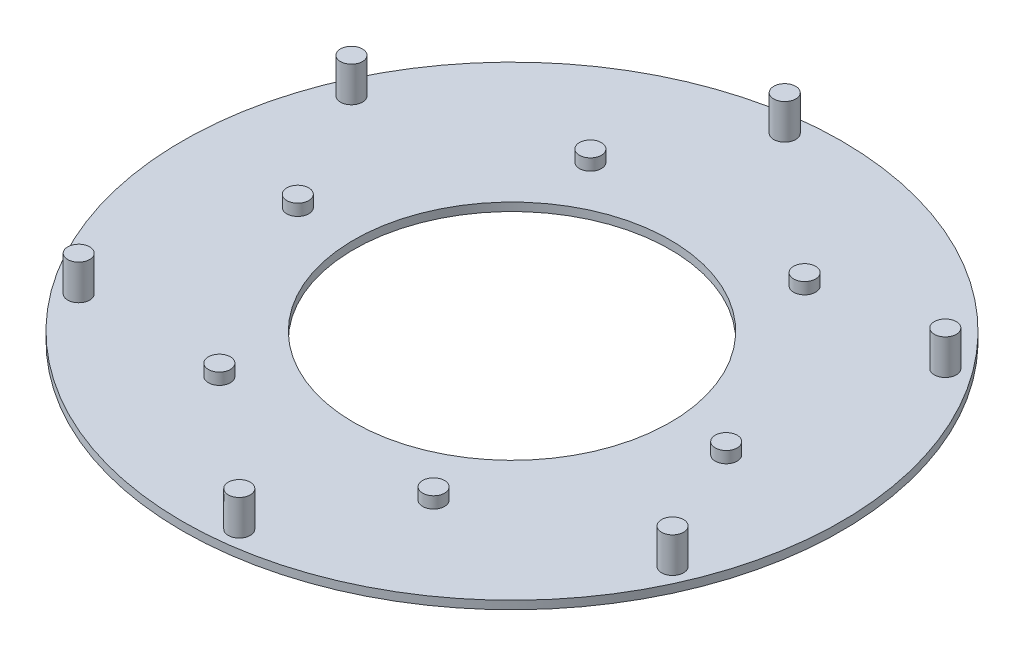
ISO-10303-21;
HEADER;
FILE_DESCRIPTION(('STEP AP214'),'2;1');
FILE_NAME('part.step','',(''),(''),'','','');
FILE_SCHEMA(('AUTOMOTIVE_DESIGN { 1 0 10303 214 1 1 1 1 }'));
ENDSEC;
DATA;
#1=APPLICATION_CONTEXT('core data for automotive mechanical design processes');
#2=APPLICATION_PROTOCOL_DEFINITION('international standard','automotive_design',2000,#1);
#3=PRODUCT_CONTEXT('',#1,'mechanical');
#4=PRODUCT('Part','Part','',(#3));
#5=PRODUCT_RELATED_PRODUCT_CATEGORY('part','',(#4));
#6=PRODUCT_DEFINITION_FORMATION('','',#4);
#7=PRODUCT_DEFINITION_CONTEXT('part definition',#1,'design');
#8=PRODUCT_DEFINITION('design','',#6,#7);
#9=PRODUCT_DEFINITION_SHAPE('','',#8);
#10=(LENGTH_UNIT() NAMED_UNIT(*) SI_UNIT(.MILLI.,.METRE.));
#11=(NAMED_UNIT(*) PLANE_ANGLE_UNIT() SI_UNIT($,.RADIAN.));
#12=(NAMED_UNIT(*) SI_UNIT($,.STERADIAN.) SOLID_ANGLE_UNIT());
#13=UNCERTAINTY_MEASURE_WITH_UNIT(LENGTH_MEASURE(1.E-05),#10,'distance_accuracy_value','');
#14=(GEOMETRIC_REPRESENTATION_CONTEXT(3) GLOBAL_UNCERTAINTY_ASSIGNED_CONTEXT((#13)) GLOBAL_UNIT_ASSIGNED_CONTEXT((#10,
#11,#12)) REPRESENTATION_CONTEXT('',''));
#15=CARTESIAN_POINT('',(0.,0.,0.));
#16=DIRECTION('',(0.,0.,1.));
#17=DIRECTION('',(1.,0.,0.));
#18=AXIS2_PLACEMENT_3D('',#15,#16,#17);
#19=CARTESIAN_POINT('',(0.,3.0625,0.));
#20=DIRECTION('',(0.,1.,0.));
#21=DIRECTION('',(0.,0.,1.));
#22=AXIS2_PLACEMENT_3D('',#19,#20,#21);
#23=PLANE('',#22);
#24=CARTESIAN_POINT('',(-4.7884959423829,3.0625,-42.0280894951196));
#25=DIRECTION('',(0.,1.,0.));
#26=DIRECTION('',(0.,0.,1.));
#27=AXIS2_PLACEMENT_3D('',#24,#25,#26);
#28=CIRCLE('',#27,1.5);
#29=CARTESIAN_POINT('',(-4.7884959423829,3.0625,-40.5280894951196));
#30=VERTEX_POINT('',#29);
#31=EDGE_CURVE('E10',#30,#30,#28,.T.);
#32=ORIENTED_EDGE('',*,*,#31,.F.);
#33=EDGE_LOOP('',(#32));
#34=FACE_BOUND('',#33,.T.);
#35=CARTESIAN_POINT('',(34.0031452041081,3.0625,-25.161003879582));
#36=DIRECTION('',(0.,1.,0.));
#37=DIRECTION('',(0.,0.,1.));
#38=AXIS2_PLACEMENT_3D('',#35,#36,#37);
#39=CIRCLE('',#38,1.5);
#40=CARTESIAN_POINT('',(34.0031452041081,3.0625,-23.661003879582));
#41=VERTEX_POINT('',#40);
#42=EDGE_CURVE('E49',#41,#41,#39,.T.);
#43=ORIENTED_EDGE('',*,*,#42,.F.);
#44=EDGE_LOOP('',(#43));
#45=FACE_BOUND('',#44,.T.);
#46=CARTESIAN_POINT('',(38.7916411464907,3.0625,16.867085615538));
#47=DIRECTION('',(0.,1.,0.));
#48=DIRECTION('',(0.,0.,1.));
#49=AXIS2_PLACEMENT_3D('',#46,#47,#48);
#50=CIRCLE('',#49,1.5);
#51=CARTESIAN_POINT('',(38.7916411464907,3.0625,18.367085615538));
#52=VERTEX_POINT('',#51);
#53=EDGE_CURVE('E54',#52,#52,#50,.T.);
#54=ORIENTED_EDGE('',*,*,#53,.F.);
#55=EDGE_LOOP('',(#54));
#56=FACE_BOUND('',#55,.T.);
#57=CARTESIAN_POINT('',(4.7884959423826,3.0625,42.0280894951197));
#58=DIRECTION('',(0.,1.,0.));
#59=DIRECTION('',(0.,0.,1.));
#60=AXIS2_PLACEMENT_3D('',#57,#58,#59);
#61=CIRCLE('',#60,1.5);
#62=CARTESIAN_POINT('',(4.7884959423826,3.0625,43.5280894951197));
#63=VERTEX_POINT('',#62);
#64=EDGE_CURVE('E68',#63,#63,#61,.T.);
#65=ORIENTED_EDGE('',*,*,#64,.F.);
#66=EDGE_LOOP('',(#65));
#67=FACE_BOUND('',#66,.T.);
#68=CARTESIAN_POINT('',(-34.0031452041083,3.0625,25.1610038795818));
#69=DIRECTION('',(0.,1.,0.));
#70=DIRECTION('',(0.,0.,1.));
#71=AXIS2_PLACEMENT_3D('',#68,#69,#70);
#72=CIRCLE('',#71,1.5);
#73=CARTESIAN_POINT('',(-34.0031452041083,3.0625,26.6610038795818));
#74=VERTEX_POINT('',#73);
#75=EDGE_CURVE('E74',#74,#74,#72,.T.);
#76=ORIENTED_EDGE('',*,*,#75,.F.);
#77=EDGE_LOOP('',(#76));
#78=FACE_BOUND('',#77,.T.);
#79=CARTESIAN_POINT('',(-29.2499999999986,3.0625,-5.78712308488233E-13));
#80=DIRECTION('',(0.,1.,0.));
#81=DIRECTION('',(0.,0.,1.));
#82=AXIS2_PLACEMENT_3D('',#79,#80,#81);
#83=CIRCLE('',#82,1.50000000000084);
#84=CARTESIAN_POINT('',(-29.2499999999986,3.0625,1.50000000000026));
#85=VERTEX_POINT('',#84);
#86=EDGE_CURVE('E80',#85,#85,#83,.T.);
#87=ORIENTED_EDGE('',*,*,#86,.F.);
#88=EDGE_LOOP('',(#87));
#89=FACE_BOUND('',#88,.T.);
#90=CARTESIAN_POINT('',(-14.6249999999974,3.0625,-25.3312430606947));
#91=DIRECTION('',(0.,1.,0.));
#92=DIRECTION('',(0.,0.,1.));
#93=AXIS2_PLACEMENT_3D('',#90,#91,#92);
#94=CIRCLE('',#93,1.50000000000237);
#95=CARTESIAN_POINT('',(-14.6249999999974,3.0625,-23.8312430606923));
#96=VERTEX_POINT('',#95);
#97=EDGE_CURVE('E86',#96,#96,#94,.T.);
#98=ORIENTED_EDGE('',*,*,#97,.F.);
#99=EDGE_LOOP('',(#98));
#100=FACE_BOUND('',#99,.T.);
#101=CARTESIAN_POINT('',(14.6250000000026,3.0625,-25.3312430606933));
#102=DIRECTION('',(0.,1.,0.));
#103=DIRECTION('',(0.,0.,1.));
#104=AXIS2_PLACEMENT_3D('',#101,#102,#103);
#105=CIRCLE('',#104,1.50000000000342);
#106=CARTESIAN_POINT('',(14.6250000000026,3.0625,-23.8312430606899));
#107=VERTEX_POINT('',#106);
#108=EDGE_CURVE('E92',#107,#107,#105,.T.);
#109=ORIENTED_EDGE('',*,*,#108,.F.);
#110=EDGE_LOOP('',(#109));
#111=FACE_BOUND('',#110,.T.);
#112=CARTESIAN_POINT('',(29.2500000000014,3.0625,2.21282182285838E-12));
#113=DIRECTION('',(0.,1.,0.));
#114=DIRECTION('',(0.,0.,1.));
#115=AXIS2_PLACEMENT_3D('',#112,#113,#114);
#116=CIRCLE('',#115,1.50000000000287);
#117=CARTESIAN_POINT('',(29.2500000000014,3.0625,1.50000000000508));
#118=VERTEX_POINT('',#117);
#119=EDGE_CURVE('E98',#118,#118,#116,.T.);
#120=ORIENTED_EDGE('',*,*,#119,.F.);
#121=EDGE_LOOP('',(#120));
#122=FACE_BOUND('',#121,.T.);
#123=CARTESIAN_POINT('',(14.6250000000002,3.0625,25.3312430606964));
#124=DIRECTION('',(0.,1.,0.));
#125=DIRECTION('',(0.,0.,1.));
#126=AXIS2_PLACEMENT_3D('',#123,#124,#125);
#127=CIRCLE('',#126,1.5000000000012);
#128=CARTESIAN_POINT('',(14.6250000000002,3.0625,26.8312430606976));
#129=VERTEX_POINT('',#128);
#130=EDGE_CURVE('E104',#129,#129,#127,.T.);
#131=ORIENTED_EDGE('',*,*,#130,.F.);
#132=EDGE_LOOP('',(#131));
#133=FACE_BOUND('',#132,.T.);
#134=CARTESIAN_POINT('',(-14.6249999999998,3.0625,25.331243060695));
#135=DIRECTION('',(0.,1.,0.));
#136=DIRECTION('',(0.,0.,1.));
#137=AXIS2_PLACEMENT_3D('',#134,#135,#136);
#138=CIRCLE('',#137,1.5);
#139=CARTESIAN_POINT('',(-14.6249999999998,3.0625,26.831243060695));
#140=VERTEX_POINT('',#139);
#141=EDGE_CURVE('E110',#140,#140,#138,.T.);
#142=ORIENTED_EDGE('',*,*,#141,.F.);
#143=EDGE_LOOP('',(#142));
#144=FACE_BOUND('',#143,.T.);
#145=CARTESIAN_POINT('',(-38.7916411464907,3.0625,-16.867085615538));
#146=DIRECTION('',(0.,1.,0.));
#147=DIRECTION('',(0.,0.,1.));
#148=AXIS2_PLACEMENT_3D('',#145,#146,#147);
#149=CIRCLE('',#148,1.5);
#150=CARTESIAN_POINT('',(-38.7916411464907,3.0625,-15.367085615538));
#151=VERTEX_POINT('',#150);
#152=EDGE_CURVE('E116',#151,#151,#149,.T.);
#153=ORIENTED_EDGE('',*,*,#152,.F.);
#154=EDGE_LOOP('',(#153));
#155=FACE_BOUND('',#154,.T.);
#156=CARTESIAN_POINT('',(0.,3.0625,0.));
#157=DIRECTION('',(0.,1.,0.));
#158=DIRECTION('',(0.,0.,1.));
#159=AXIS2_PLACEMENT_3D('',#156,#157,#158);
#160=CIRCLE('',#159,45.);
#161=CARTESIAN_POINT('',(0.,3.0625,45.));
#162=VERTEX_POINT('',#161);
#163=EDGE_CURVE('E122',#162,#162,#160,.T.);
#164=ORIENTED_EDGE('',*,*,#163,.T.);
#165=EDGE_LOOP('',(#164));
#166=FACE_BOUND('',#165,.T.);
#167=CARTESIAN_POINT('',(0.,3.0625,0.));
#168=DIRECTION('',(0.,1.,0.));
#169=DIRECTION('',(0.,0.,1.));
#170=AXIS2_PLACEMENT_3D('',#167,#168,#169);
#171=CIRCLE('',#170,21.6);
#172=CARTESIAN_POINT('',(0.,3.0625,21.6));
#173=VERTEX_POINT('',#172);
#174=EDGE_CURVE('E123',#173,#173,#171,.T.);
#175=ORIENTED_EDGE('',*,*,#174,.F.);
#176=EDGE_LOOP('',(#175));
#177=FACE_BOUND('',#176,.T.);
#178=ADVANCED_FACE('F41',(#34,#45,#56,#67,#78,#89,#100,#111,#122,#133,#144,#155,#166,#177),#23,.T.);
#179=CARTESIAN_POINT('',(0.,1.9375,0.));
#180=DIRECTION('',(0.,1.,0.));
#181=DIRECTION('',(0.,0.,1.));
#182=AXIS2_PLACEMENT_3D('',#179,#180,#181);
#183=PLANE('',#182);
#184=CARTESIAN_POINT('',(0.,1.9375,0.));
#185=DIRECTION('',(0.,1.,0.));
#186=DIRECTION('',(0.,0.,1.));
#187=AXIS2_PLACEMENT_3D('',#184,#185,#186);
#188=CIRCLE('',#187,45.);
#189=CARTESIAN_POINT('',(0.,1.9375,45.));
#190=VERTEX_POINT('',#189);
#191=EDGE_CURVE('E45',#190,#190,#188,.T.);
#192=ORIENTED_EDGE('',*,*,#191,.F.);
#193=EDGE_LOOP('',(#192));
#194=FACE_BOUND('',#193,.T.);
#195=CARTESIAN_POINT('',(0.,1.9375,0.));
#196=DIRECTION('',(0.,1.,0.));
#197=DIRECTION('',(0.,0.,1.));
#198=AXIS2_PLACEMENT_3D('',#195,#196,#197);
#199=CIRCLE('',#198,21.6);
#200=CARTESIAN_POINT('',(0.,1.9375,21.6));
#201=VERTEX_POINT('',#200);
#202=EDGE_CURVE('E119',#201,#201,#199,.T.);
#203=ORIENTED_EDGE('',*,*,#202,.T.);
#204=EDGE_LOOP('',(#203));
#205=FACE_BOUND('',#204,.T.);
#206=ADVANCED_FACE('F134',(#194,#205),#183,.F.);
#207=CARTESIAN_POINT('',(0.,3.0625,0.));
#208=DIRECTION('',(0.,-1.,0.));
#209=DIRECTION('',(0.,0.,-1.));
#210=AXIS2_PLACEMENT_3D('',#207,#208,#209);
#211=CYLINDRICAL_SURFACE('',#210,45.);
#212=ORIENTED_EDGE('',*,*,#163,.F.);
#213=EDGE_LOOP('',(#212));
#214=FACE_BOUND('',#213,.T.);
#215=ORIENTED_EDGE('',*,*,#191,.T.);
#216=EDGE_LOOP('',(#215));
#217=FACE_BOUND('',#216,.T.);
#218=ADVANCED_FACE('F43',(#214,#217),#211,.T.);
#219=CARTESIAN_POINT('',(0.,3.0625,0.));
#220=DIRECTION('',(0.,-1.,0.));
#221=DIRECTION('',(0.,0.,-1.));
#222=AXIS2_PLACEMENT_3D('',#219,#220,#221);
#223=CYLINDRICAL_SURFACE('',#222,21.6);
#224=ORIENTED_EDGE('',*,*,#174,.T.);
#225=EDGE_LOOP('',(#224));
#226=FACE_BOUND('',#225,.T.);
#227=ORIENTED_EDGE('',*,*,#202,.F.);
#228=EDGE_LOOP('',(#227));
#229=FACE_BOUND('',#228,.T.);
#230=ADVANCED_FACE('F139',(#226,#229),#223,.F.);
#231=CARTESIAN_POINT('',(-38.7916411464907,7.8675,-16.867085615538));
#232=DIRECTION('',(0.,-1.,0.));
#233=DIRECTION('',(0.,0.,-1.));
#234=AXIS2_PLACEMENT_3D('',#231,#232,#233);
#235=CYLINDRICAL_SURFACE('',#234,1.5);
#236=ORIENTED_EDGE('',*,*,#152,.T.);
#237=EDGE_LOOP('',(#236));
#238=FACE_BOUND('',#237,.T.);
#239=CARTESIAN_POINT('',(-38.7916411464907,7.8675,-16.867085615538));
#240=DIRECTION('',(0.,-1.,0.));
#241=DIRECTION('',(0.,0.,-1.));
#242=AXIS2_PLACEMENT_3D('',#239,#240,#241);
#243=CIRCLE('',#242,1.5);
#244=CARTESIAN_POINT('',(-38.7916411464907,7.8675,-18.367085615538));
#245=VERTEX_POINT('',#244);
#246=EDGE_CURVE('E113',#245,#245,#243,.T.);
#247=ORIENTED_EDGE('',*,*,#246,.T.);
#248=EDGE_LOOP('',(#247));
#249=FACE_BOUND('',#248,.T.);
#250=ADVANCED_FACE('F141',(#238,#249),#235,.T.);
#251=CARTESIAN_POINT('',(-38.7916411464907,7.8675,-16.867085615538));
#252=DIRECTION('',(0.,-1.,0.));
#253=DIRECTION('',(0.,0.,-1.));
#254=AXIS2_PLACEMENT_3D('',#251,#252,#253);
#255=PLANE('',#254);
#256=ORIENTED_EDGE('',*,*,#246,.F.);
#257=EDGE_LOOP('',(#256));
#258=FACE_BOUND('',#257,.T.);
#259=ADVANCED_FACE('F148',(#258),#255,.F.);
#260=CARTESIAN_POINT('',(-14.6249999999998,4.6375,25.331243060695));
#261=DIRECTION('',(0.,-1.,0.));
#262=DIRECTION('',(0.,0.,-1.));
#263=AXIS2_PLACEMENT_3D('',#260,#261,#262);
#264=CYLINDRICAL_SURFACE('',#263,1.5);
#265=ORIENTED_EDGE('',*,*,#141,.T.);
#266=EDGE_LOOP('',(#265));
#267=FACE_BOUND('',#266,.T.);
#268=CARTESIAN_POINT('',(-14.6249999999998,4.6375,25.331243060695));
#269=DIRECTION('',(0.,-1.,0.));
#270=DIRECTION('',(0.,0.,-1.));
#271=AXIS2_PLACEMENT_3D('',#268,#269,#270);
#272=CIRCLE('',#271,1.5);
#273=CARTESIAN_POINT('',(-14.6249999999998,4.6375,23.831243060695));
#274=VERTEX_POINT('',#273);
#275=EDGE_CURVE('E107',#274,#274,#272,.T.);
#276=ORIENTED_EDGE('',*,*,#275,.T.);
#277=EDGE_LOOP('',(#276));
#278=FACE_BOUND('',#277,.T.);
#279=ADVANCED_FACE('F187',(#267,#278),#264,.T.);
#280=CARTESIAN_POINT('',(-14.6249999999998,4.6375,25.331243060695));
#281=DIRECTION('',(0.,-1.,0.));
#282=DIRECTION('',(0.,0.,-1.));
#283=AXIS2_PLACEMENT_3D('',#280,#281,#282);
#284=PLANE('',#283);
#285=ORIENTED_EDGE('',*,*,#275,.F.);
#286=EDGE_LOOP('',(#285));
#287=FACE_BOUND('',#286,.T.);
#288=ADVANCED_FACE('F192',(#287),#284,.F.);
#289=CARTESIAN_POINT('',(14.6250000000002,4.6375,25.3312430606964));
#290=DIRECTION('',(0.,-1.,0.));
#291=DIRECTION('',(0.,0.,-1.));
#292=AXIS2_PLACEMENT_3D('',#289,#290,#291);
#293=CYLINDRICAL_SURFACE('',#292,1.5000000000012);
#294=ORIENTED_EDGE('',*,*,#130,.T.);
#295=EDGE_LOOP('',(#294));
#296=FACE_BOUND('',#295,.T.);
#297=CARTESIAN_POINT('',(14.6250000000002,4.6375,25.3312430606964));
#298=DIRECTION('',(0.,-1.,0.));
#299=DIRECTION('',(0.,0.,-1.));
#300=AXIS2_PLACEMENT_3D('',#297,#298,#299);
#301=CIRCLE('',#300,1.5000000000012);
#302=CARTESIAN_POINT('',(14.6250000000002,4.6375,23.8312430606951));
#303=VERTEX_POINT('',#302);
#304=EDGE_CURVE('E101',#303,#303,#301,.T.);
#305=ORIENTED_EDGE('',*,*,#304,.T.);
#306=EDGE_LOOP('',(#305));
#307=FACE_BOUND('',#306,.T.);
#308=ADVANCED_FACE('F198',(#296,#307),#293,.T.);
#309=CARTESIAN_POINT('',(14.6250000000002,4.6375,25.3312430606964));
#310=DIRECTION('',(0.,-1.,0.));
#311=DIRECTION('',(0.,0.,-1.));
#312=AXIS2_PLACEMENT_3D('',#309,#310,#311);
#313=PLANE('',#312);
#314=ORIENTED_EDGE('',*,*,#304,.F.);
#315=EDGE_LOOP('',(#314));
#316=FACE_BOUND('',#315,.T.);
#317=ADVANCED_FACE('F202',(#316),#313,.F.);
#318=CARTESIAN_POINT('',(29.2500000000014,4.6375,2.21282182285838E-12));
#319=DIRECTION('',(0.,-1.,0.));
#320=DIRECTION('',(0.,0.,-1.));
#321=AXIS2_PLACEMENT_3D('',#318,#319,#320);
#322=CYLINDRICAL_SURFACE('',#321,1.50000000000287);
#323=ORIENTED_EDGE('',*,*,#119,.T.);
#324=EDGE_LOOP('',(#323));
#325=FACE_BOUND('',#324,.T.);
#326=CARTESIAN_POINT('',(29.2500000000014,4.6375,2.21282182285838E-12));
#327=DIRECTION('',(0.,-1.,0.));
#328=DIRECTION('',(0.,0.,-1.));
#329=AXIS2_PLACEMENT_3D('',#326,#327,#328);
#330=CIRCLE('',#329,1.50000000000287);
#331=CARTESIAN_POINT('',(29.2500000000014,4.6375,-1.50000000000066));
#332=VERTEX_POINT('',#331);
#333=EDGE_CURVE('E95',#332,#332,#330,.T.);
#334=ORIENTED_EDGE('',*,*,#333,.T.);
#335=EDGE_LOOP('',(#334));
#336=FACE_BOUND('',#335,.T.);
#337=ADVANCED_FACE('F206',(#325,#336),#322,.T.);
#338=CARTESIAN_POINT('',(29.2500000000014,4.6375,2.21282182285838E-12));
#339=DIRECTION('',(0.,-1.,0.));
#340=DIRECTION('',(0.,0.,-1.));
#341=AXIS2_PLACEMENT_3D('',#338,#339,#340);
#342=PLANE('',#341);
#343=ORIENTED_EDGE('',*,*,#333,.F.);
#344=EDGE_LOOP('',(#343));
#345=FACE_BOUND('',#344,.T.);
#346=ADVANCED_FACE('F210',(#345),#342,.F.);
#347=CARTESIAN_POINT('',(14.6250000000026,4.6375,-25.3312430606933));
#348=DIRECTION('',(0.,-1.,0.));
#349=DIRECTION('',(0.,0.,-1.));
#350=AXIS2_PLACEMENT_3D('',#347,#348,#349);
#351=CYLINDRICAL_SURFACE('',#350,1.50000000000342);
#352=ORIENTED_EDGE('',*,*,#108,.T.);
#353=EDGE_LOOP('',(#352));
#354=FACE_BOUND('',#353,.T.);
#355=CARTESIAN_POINT('',(14.6250000000026,4.6375,-25.3312430606933));
#356=DIRECTION('',(0.,-1.,0.));
#357=DIRECTION('',(0.,0.,-1.));
#358=AXIS2_PLACEMENT_3D('',#355,#356,#357);
#359=CIRCLE('',#358,1.50000000000342);
#360=CARTESIAN_POINT('',(14.6250000000026,4.6375,-26.8312430606967));
#361=VERTEX_POINT('',#360);
#362=EDGE_CURVE('E89',#361,#361,#359,.T.);
#363=ORIENTED_EDGE('',*,*,#362,.T.);
#364=EDGE_LOOP('',(#363));
#365=FACE_BOUND('',#364,.T.);
#366=ADVANCED_FACE('F214',(#354,#365),#351,.T.);
#367=CARTESIAN_POINT('',(14.6250000000026,4.6375,-25.3312430606933));
#368=DIRECTION('',(0.,-1.,0.));
#369=DIRECTION('',(0.,0.,-1.));
#370=AXIS2_PLACEMENT_3D('',#367,#368,#369);
#371=PLANE('',#370);
#372=ORIENTED_EDGE('',*,*,#362,.F.);
#373=EDGE_LOOP('',(#372));
#374=FACE_BOUND('',#373,.T.);
#375=ADVANCED_FACE('F218',(#374),#371,.F.);
#376=CARTESIAN_POINT('',(-14.6249999999974,4.6375,-25.3312430606947));
#377=DIRECTION('',(0.,-1.,0.));
#378=DIRECTION('',(0.,0.,-1.));
#379=AXIS2_PLACEMENT_3D('',#376,#377,#378);
#380=CYLINDRICAL_SURFACE('',#379,1.50000000000237);
#381=ORIENTED_EDGE('',*,*,#97,.T.);
#382=EDGE_LOOP('',(#381));
#383=FACE_BOUND('',#382,.T.);
#384=CARTESIAN_POINT('',(-14.6249999999974,4.6375,-25.3312430606947));
#385=DIRECTION('',(0.,-1.,0.));
#386=DIRECTION('',(0.,0.,-1.));
#387=AXIS2_PLACEMENT_3D('',#384,#385,#386);
#388=CIRCLE('',#387,1.50000000000237);
#389=CARTESIAN_POINT('',(-14.6249999999974,4.6375,-26.8312430606971));
#390=VERTEX_POINT('',#389);
#391=EDGE_CURVE('E83',#390,#390,#388,.T.);
#392=ORIENTED_EDGE('',*,*,#391,.T.);
#393=EDGE_LOOP('',(#392));
#394=FACE_BOUND('',#393,.T.);
#395=ADVANCED_FACE('F222',(#383,#394),#380,.T.);
#396=CARTESIAN_POINT('',(-14.6249999999974,4.6375,-25.3312430606947));
#397=DIRECTION('',(0.,-1.,0.));
#398=DIRECTION('',(0.,0.,-1.));
#399=AXIS2_PLACEMENT_3D('',#396,#397,#398);
#400=PLANE('',#399);
#401=ORIENTED_EDGE('',*,*,#391,.F.);
#402=EDGE_LOOP('',(#401));
#403=FACE_BOUND('',#402,.T.);
#404=ADVANCED_FACE('F226',(#403),#400,.F.);
#405=CARTESIAN_POINT('',(-29.2499999999986,4.6375,-5.78712308488233E-13));
#406=DIRECTION('',(0.,-1.,0.));
#407=DIRECTION('',(0.,0.,-1.));
#408=AXIS2_PLACEMENT_3D('',#405,#406,#407);
#409=CYLINDRICAL_SURFACE('',#408,1.50000000000084);
#410=ORIENTED_EDGE('',*,*,#86,.T.);
#411=EDGE_LOOP('',(#410));
#412=FACE_BOUND('',#411,.T.);
#413=CARTESIAN_POINT('',(-29.2499999999986,4.6375,-5.78712308488233E-13));
#414=DIRECTION('',(0.,-1.,0.));
#415=DIRECTION('',(0.,0.,-1.));
#416=AXIS2_PLACEMENT_3D('',#413,#414,#415);
#417=CIRCLE('',#416,1.50000000000084);
#418=CARTESIAN_POINT('',(-29.2499999999986,4.6375,-1.50000000000142));
#419=VERTEX_POINT('',#418);
#420=EDGE_CURVE('E77',#419,#419,#417,.T.);
#421=ORIENTED_EDGE('',*,*,#420,.T.);
#422=EDGE_LOOP('',(#421));
#423=FACE_BOUND('',#422,.T.);
#424=ADVANCED_FACE('F230',(#412,#423),#409,.T.);
#425=CARTESIAN_POINT('',(-29.2499999999986,4.6375,-5.78712308488233E-13));
#426=DIRECTION('',(0.,-1.,0.));
#427=DIRECTION('',(0.,0.,-1.));
#428=AXIS2_PLACEMENT_3D('',#425,#426,#427);
#429=PLANE('',#428);
#430=ORIENTED_EDGE('',*,*,#420,.F.);
#431=EDGE_LOOP('',(#430));
#432=FACE_BOUND('',#431,.T.);
#433=ADVANCED_FACE('F234',(#432),#429,.F.);
#434=CARTESIAN_POINT('',(-34.0031452041083,7.8675,25.1610038795818));
#435=DIRECTION('',(0.,-1.,0.));
#436=DIRECTION('',(0.,0.,-1.));
#437=AXIS2_PLACEMENT_3D('',#434,#435,#436);
#438=CYLINDRICAL_SURFACE('',#437,1.5);
#439=ORIENTED_EDGE('',*,*,#75,.T.);
#440=EDGE_LOOP('',(#439));
#441=FACE_BOUND('',#440,.T.);
#442=CARTESIAN_POINT('',(-34.0031452041083,7.8675,25.1610038795818));
#443=DIRECTION('',(0.,-1.,0.));
#444=DIRECTION('',(-0.86602540378444,0.,-0.499999999999998));
#445=AXIS2_PLACEMENT_3D('',#442,#443,#444);
#446=CIRCLE('',#445,1.5);
#447=CARTESIAN_POINT('',(-35.3021833097849,7.8675,24.4110038795818));
#448=VERTEX_POINT('',#447);
#449=EDGE_CURVE('E71',#448,#448,#446,.T.);
#450=ORIENTED_EDGE('',*,*,#449,.T.);
#451=EDGE_LOOP('',(#450));
#452=FACE_BOUND('',#451,.T.);
#453=ADVANCED_FACE('F238',(#441,#452),#438,.T.);
#454=CARTESIAN_POINT('',(-34.0031452041083,7.8675,25.1610038795818));
#455=DIRECTION('',(0.,-1.,0.));
#456=DIRECTION('',(-0.86602540378444,0.,-0.499999999999998));
#457=AXIS2_PLACEMENT_3D('',#454,#455,#456);
#458=PLANE('',#457);
#459=ORIENTED_EDGE('',*,*,#449,.F.);
#460=EDGE_LOOP('',(#459));
#461=FACE_BOUND('',#460,.T.);
#462=ADVANCED_FACE('F242',(#461),#458,.F.);
#463=CARTESIAN_POINT('',(4.7884959423826,7.8675,42.0280894951197));
#464=DIRECTION('',(0.,-1.,0.));
#465=DIRECTION('',(0.,0.,-1.));
#466=AXIS2_PLACEMENT_3D('',#463,#464,#465);
#467=CYLINDRICAL_SURFACE('',#466,1.5);
#468=ORIENTED_EDGE('',*,*,#64,.T.);
#469=EDGE_LOOP('',(#468));
#470=FACE_BOUND('',#469,.T.);
#471=CARTESIAN_POINT('',(4.7884959423826,7.8675,42.0280894951197));
#472=DIRECTION('',(0.,-1.,0.));
#473=DIRECTION('',(-0.866025403784436,0.,0.500000000000004));
#474=AXIS2_PLACEMENT_3D('',#471,#472,#473);
#475=CIRCLE('',#474,1.5);
#476=CARTESIAN_POINT('',(3.48945783670594,7.8675,42.7780894951197));
#477=VERTEX_POINT('',#476);
#478=EDGE_CURVE('E65',#477,#477,#475,.T.);
#479=ORIENTED_EDGE('',*,*,#478,.T.);
#480=EDGE_LOOP('',(#479));
#481=FACE_BOUND('',#480,.T.);
#482=ADVANCED_FACE('F246',(#470,#481),#467,.T.);
#483=CARTESIAN_POINT('',(4.7884959423826,7.8675,42.0280894951197));
#484=DIRECTION('',(0.,-1.,0.));
#485=DIRECTION('',(-0.866025403784436,0.,0.500000000000004));
#486=AXIS2_PLACEMENT_3D('',#483,#484,#485);
#487=PLANE('',#486);
#488=ORIENTED_EDGE('',*,*,#478,.F.);
#489=EDGE_LOOP('',(#488));
#490=FACE_BOUND('',#489,.T.);
#491=ADVANCED_FACE('F250',(#490),#487,.F.);
#492=CARTESIAN_POINT('',(38.7916411464907,7.8675,16.867085615538));
#493=DIRECTION('',(0.,-1.,0.));
#494=DIRECTION('',(0.,0.,-1.));
#495=AXIS2_PLACEMENT_3D('',#492,#493,#494);
#496=CYLINDRICAL_SURFACE('',#495,1.5);
#497=ORIENTED_EDGE('',*,*,#53,.T.);
#498=EDGE_LOOP('',(#497));
#499=FACE_BOUND('',#498,.T.);
#500=CARTESIAN_POINT('',(38.7916411464907,7.8675,16.867085615538));
#501=DIRECTION('',(0.,-1.,0.));
#502=DIRECTION('',(0.,0.,1.));
#503=AXIS2_PLACEMENT_3D('',#500,#501,#502);
#504=CIRCLE('',#503,1.5);
#505=CARTESIAN_POINT('',(38.7916411464907,7.8675,18.367085615538));
#506=VERTEX_POINT('',#505);
#507=EDGE_CURVE('E61',#506,#506,#504,.T.);
#508=ORIENTED_EDGE('',*,*,#507,.T.);
#509=EDGE_LOOP('',(#508));
#510=FACE_BOUND('',#509,.T.);
#511=ADVANCED_FACE('F254',(#499,#510),#496,.T.);
#512=CARTESIAN_POINT('',(38.7916411464907,7.8675,16.867085615538));
#513=DIRECTION('',(0.,-1.,0.));
#514=DIRECTION('',(0.,0.,1.));
#515=AXIS2_PLACEMENT_3D('',#512,#513,#514);
#516=PLANE('',#515);
#517=ORIENTED_EDGE('',*,*,#507,.F.);
#518=EDGE_LOOP('',(#517));
#519=FACE_BOUND('',#518,.T.);
#520=ADVANCED_FACE('F258',(#519),#516,.F.);
#521=CARTESIAN_POINT('',(34.0031452041081,7.8675,-25.161003879582));
#522=DIRECTION('',(0.,-1.,0.));
#523=DIRECTION('',(0.,0.,-1.));
#524=AXIS2_PLACEMENT_3D('',#521,#522,#523);
#525=CYLINDRICAL_SURFACE('',#524,1.5);
#526=ORIENTED_EDGE('',*,*,#42,.T.);
#527=EDGE_LOOP('',(#526));
#528=FACE_BOUND('',#527,.T.);
#529=CARTESIAN_POINT('',(34.0031452041081,7.8675,-25.161003879582));
#530=DIRECTION('',(0.,-1.,0.));
#531=DIRECTION('',(0.866025403784443,0.,0.499999999999992));
#532=AXIS2_PLACEMENT_3D('',#529,#530,#531);
#533=CIRCLE('',#532,1.5);
#534=CARTESIAN_POINT('',(35.3021833097848,7.8675,-24.411003879582));
#535=VERTEX_POINT('',#534);
#536=EDGE_CURVE('E59',#535,#535,#533,.T.);
#537=ORIENTED_EDGE('',*,*,#536,.T.);
#538=EDGE_LOOP('',(#537));
#539=FACE_BOUND('',#538,.T.);
#540=ADVANCED_FACE('F262',(#528,#539),#525,.T.);
#541=CARTESIAN_POINT('',(34.0031452041081,7.8675,-25.161003879582));
#542=DIRECTION('',(0.,-1.,0.));
#543=DIRECTION('',(0.866025403784443,0.,0.499999999999992));
#544=AXIS2_PLACEMENT_3D('',#541,#542,#543);
#545=PLANE('',#544);
#546=ORIENTED_EDGE('',*,*,#536,.F.);
#547=EDGE_LOOP('',(#546));
#548=FACE_BOUND('',#547,.T.);
#549=ADVANCED_FACE('F266',(#548),#545,.F.);
#550=CARTESIAN_POINT('',(-4.7884959423829,7.8675,-42.0280894951196));
#551=DIRECTION('',(0.,-1.,0.));
#552=DIRECTION('',(0.,0.,-1.));
#553=AXIS2_PLACEMENT_3D('',#550,#551,#552);
#554=CYLINDRICAL_SURFACE('',#553,1.5);
#555=ORIENTED_EDGE('',*,*,#31,.T.);
#556=EDGE_LOOP('',(#555));
#557=FACE_BOUND('',#556,.T.);
#558=CARTESIAN_POINT('',(-4.7884959423829,7.8675,-42.0280894951196));
#559=DIRECTION('',(0.,-1.,0.));
#560=DIRECTION('',(0.866025403784433,0.,-0.50000000000001));
#561=AXIS2_PLACEMENT_3D('',#558,#559,#560);
#562=CIRCLE('',#561,1.5);
#563=CARTESIAN_POINT('',(-3.48945783670624,7.8675,-42.7780894951196));
#564=VERTEX_POINT('',#563);
#565=EDGE_CURVE('E58',#564,#564,#562,.T.);
#566=ORIENTED_EDGE('',*,*,#565,.T.);
#567=EDGE_LOOP('',(#566));
#568=FACE_BOUND('',#567,.T.);
#569=ADVANCED_FACE('F270',(#557,#568),#554,.T.);
#570=CARTESIAN_POINT('',(-4.7884959423829,7.8675,-42.0280894951196));
#571=DIRECTION('',(0.,-1.,0.));
#572=DIRECTION('',(0.866025403784433,0.,-0.50000000000001));
#573=AXIS2_PLACEMENT_3D('',#570,#571,#572);
#574=PLANE('',#573);
#575=ORIENTED_EDGE('',*,*,#565,.F.);
#576=EDGE_LOOP('',(#575));
#577=FACE_BOUND('',#576,.T.);
#578=ADVANCED_FACE('F274',(#577),#574,.F.);
#579=CLOSED_SHELL('',(#178,#206,#218,#230,#250,#259,#279,#288,#308,#317,#337,#346,#366,#375,
#395,#404,#424,#433,#453,#462,#482,#491,#511,#520,#540,#549,#569,#578));
#580=MANIFOLD_SOLID_BREP('B2',#579);
#581=ADVANCED_BREP_SHAPE_REPRESENTATION('',(#18,#580),#14);
#582=SHAPE_DEFINITION_REPRESENTATION(#9,#581);
ENDSEC;
END-ISO-10303-21;
